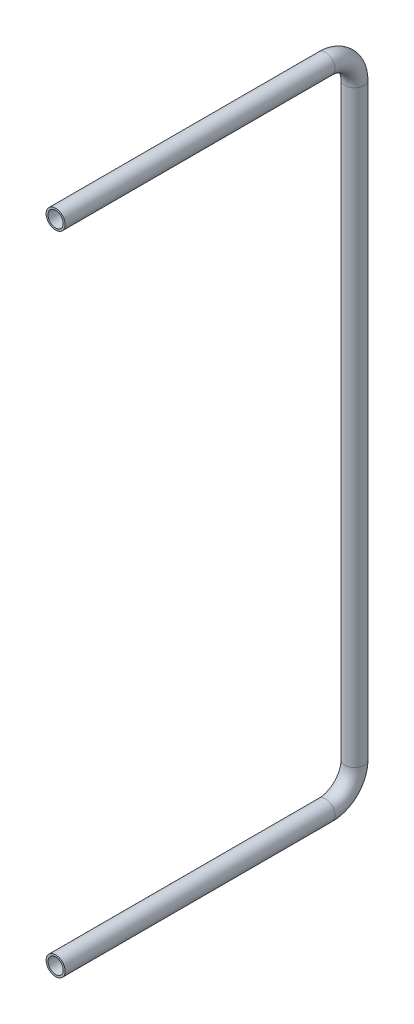
ISO-10303-21;
HEADER;
FILE_DESCRIPTION(('STEP AP214'),'2;1');
FILE_NAME('part.step','',(''),(''),'','','');
FILE_SCHEMA(('AUTOMOTIVE_DESIGN { 1 0 10303 214 1 1 1 1 }'));
ENDSEC;
DATA;
#1=APPLICATION_CONTEXT('core data for automotive mechanical design processes');
#2=APPLICATION_PROTOCOL_DEFINITION('international standard','automotive_design',2000,#1);
#3=PRODUCT_CONTEXT('',#1,'mechanical');
#4=PRODUCT('Part','Part','',(#3));
#5=PRODUCT_RELATED_PRODUCT_CATEGORY('part','',(#4));
#6=PRODUCT_DEFINITION_FORMATION('','',#4);
#7=PRODUCT_DEFINITION_CONTEXT('part definition',#1,'design');
#8=PRODUCT_DEFINITION('design','',#6,#7);
#9=PRODUCT_DEFINITION_SHAPE('','',#8);
#10=(LENGTH_UNIT() NAMED_UNIT(*) SI_UNIT(.MILLI.,.METRE.));
#11=(NAMED_UNIT(*) PLANE_ANGLE_UNIT() SI_UNIT($,.RADIAN.));
#12=(NAMED_UNIT(*) SI_UNIT($,.STERADIAN.) SOLID_ANGLE_UNIT());
#13=UNCERTAINTY_MEASURE_WITH_UNIT(LENGTH_MEASURE(1.E-05),#10,'distance_accuracy_value','');
#14=(GEOMETRIC_REPRESENTATION_CONTEXT(3) GLOBAL_UNCERTAINTY_ASSIGNED_CONTEXT((#13)) GLOBAL_UNIT_ASSIGNED_CONTEXT((#10,
#11,#12)) REPRESENTATION_CONTEXT('',''));
#15=CARTESIAN_POINT('',(0.,0.,0.));
#16=DIRECTION('',(0.,0.,1.));
#17=DIRECTION('',(1.,0.,0.));
#18=AXIS2_PLACEMENT_3D('',#15,#16,#17);
#19=CARTESIAN_POINT('',(0.,-1084.2625,-524.7005));
#20=DIRECTION('',(0.,1.,0.));
#21=DIRECTION('',(0.,0.,1.));
#22=AXIS2_PLACEMENT_3D('',#19,#20,#21);
#23=CYLINDRICAL_SURFACE('',#22,13.3223);
#24=CARTESIAN_POINT('',(0.,-50.8,-524.7005));
#25=DIRECTION('',(0.,1.,0.));
#26=DIRECTION('',(0.,0.,-1.));
#27=AXIS2_PLACEMENT_3D('',#24,#25,#26);
#28=CIRCLE('',#27,13.3223);
#29=CARTESIAN_POINT('',(0.,-50.8,-538.0228));
#30=VERTEX_POINT('',#29);
#31=EDGE_CURVE('E87',#30,#30,#28,.T.);
#32=ORIENTED_EDGE('',*,*,#31,.T.);
#33=EDGE_LOOP('',(#32));
#34=FACE_BOUND('',#33,.T.);
#35=CARTESIAN_POINT('',(0.,-1084.2625,-524.7005));
#36=DIRECTION('',(0.,1.,0.));
#37=DIRECTION('',(0.,0.,-1.));
#38=AXIS2_PLACEMENT_3D('',#35,#36,#37);
#39=CIRCLE('',#38,13.3223);
#40=CARTESIAN_POINT('',(0.,-1084.2625,-538.0228));
#41=VERTEX_POINT('',#40);
#42=EDGE_CURVE('E82',#41,#41,#39,.F.);
#43=ORIENTED_EDGE('',*,*,#42,.T.);
#44=EDGE_LOOP('',(#43));
#45=FACE_BOUND('',#44,.T.);
#46=ADVANCED_FACE('F15',(#34,#45),#23,.F.);
#47=CARTESIAN_POINT('',(0.,-50.8,-473.9005));
#48=DIRECTION('',(1.,0.,0.));
#49=DIRECTION('',(0.,0.,1.));
#50=AXIS2_PLACEMENT_3D('',#47,#48,#49);
#51=TOROIDAL_SURFACE('',#50,50.8,13.3223);
#52=CARTESIAN_POINT('',(0.,0.,-473.9005));
#53=DIRECTION('',(0.,0.,1.));
#54=DIRECTION('',(1.,0.,0.));
#55=AXIS2_PLACEMENT_3D('',#52,#53,#54);
#56=CIRCLE('',#55,13.3223);
#57=CARTESIAN_POINT('',(13.3223,0.,-473.9005));
#58=VERTEX_POINT('',#57);
#59=EDGE_CURVE('E80',#58,#58,#56,.T.);
#60=ORIENTED_EDGE('',*,*,#59,.T.);
#61=EDGE_LOOP('',(#60));
#62=FACE_BOUND('',#61,.T.);
#63=ORIENTED_EDGE('',*,*,#31,.F.);
#64=EDGE_LOOP('',(#63));
#65=FACE_BOUND('',#64,.T.);
#66=ADVANCED_FACE('F72',(#62,#65),#51,.F.);
#67=CARTESIAN_POINT('',(0.,-1084.2625,-473.9005));
#68=DIRECTION('',(1.,0.,0.));
#69=DIRECTION('',(0.,1.,0.));
#70=AXIS2_PLACEMENT_3D('',#67,#68,#69);
#71=TOROIDAL_SURFACE('',#70,50.8,13.3223);
#72=ORIENTED_EDGE('',*,*,#42,.F.);
#73=EDGE_LOOP('',(#72));
#74=FACE_BOUND('',#73,.T.);
#75=CARTESIAN_POINT('',(0.,-1135.0625,-473.9005));
#76=DIRECTION('',(0.,0.,-1.));
#77=DIRECTION('',(-1.,0.,0.));
#78=AXIS2_PLACEMENT_3D('',#75,#76,#77);
#79=CIRCLE('',#78,13.3223);
#80=CARTESIAN_POINT('',(-13.3223,-1135.0625,-473.9005));
#81=VERTEX_POINT('',#80);
#82=EDGE_CURVE('E78',#81,#81,#79,.F.);
#83=ORIENTED_EDGE('',*,*,#82,.T.);
#84=EDGE_LOOP('',(#83));
#85=FACE_BOUND('',#84,.T.);
#86=ADVANCED_FACE('F68',(#74,#85),#71,.F.);
#87=CARTESIAN_POINT('',(0.,0.,-473.9005));
#88=DIRECTION('',(0.,0.,1.));
#89=DIRECTION('',(1.,0.,0.));
#90=AXIS2_PLACEMENT_3D('',#87,#88,#89);
#91=CYLINDRICAL_SURFACE('',#90,13.3223);
#92=CARTESIAN_POINT('',(0.,0.,0.));
#93=DIRECTION('',(0.,0.,1.));
#94=DIRECTION('',(1.,0.,0.));
#95=AXIS2_PLACEMENT_3D('',#92,#93,#94);
#96=CIRCLE('',#95,13.3223);
#97=CARTESIAN_POINT('',(13.3223,0.,0.));
#98=VERTEX_POINT('',#97);
#99=EDGE_CURVE('E18',#98,#98,#96,.F.);
#100=ORIENTED_EDGE('',*,*,#99,.F.);
#101=EDGE_LOOP('',(#100));
#102=FACE_BOUND('',#101,.T.);
#103=ORIENTED_EDGE('',*,*,#59,.F.);
#104=EDGE_LOOP('',(#103));
#105=FACE_BOUND('',#104,.T.);
#106=ADVANCED_FACE('F64',(#102,#105),#91,.F.);
#107=CARTESIAN_POINT('',(0.,-1135.0625,0.));
#108=DIRECTION('',(0.,0.,-1.));
#109=DIRECTION('',(-1.,0.,0.));
#110=AXIS2_PLACEMENT_3D('',#107,#108,#109);
#111=CYLINDRICAL_SURFACE('',#110,13.3223);
#112=ORIENTED_EDGE('',*,*,#82,.F.);
#113=EDGE_LOOP('',(#112));
#114=FACE_BOUND('',#113,.T.);
#115=CARTESIAN_POINT('',(0.,-1135.0625,0.));
#116=DIRECTION('',(0.,0.,-1.));
#117=DIRECTION('',(-1.,0.,0.));
#118=AXIS2_PLACEMENT_3D('',#115,#116,#117);
#119=CIRCLE('',#118,13.3223);
#120=CARTESIAN_POINT('',(-13.3223,-1135.0625,0.));
#121=VERTEX_POINT('',#120);
#122=EDGE_CURVE('E96',#121,#121,#119,.F.);
#123=ORIENTED_EDGE('',*,*,#122,.T.);
#124=EDGE_LOOP('',(#123));
#125=FACE_BOUND('',#124,.T.);
#126=ADVANCED_FACE('F60',(#114,#125),#111,.F.);
#127=CARTESIAN_POINT('',(0.,0.,0.));
#128=DIRECTION('',(0.,0.,1.));
#129=DIRECTION('',(1.,0.,0.));
#130=AXIS2_PLACEMENT_3D('',#127,#128,#129);
#131=PLANE('',#130);
#132=ORIENTED_EDGE('',*,*,#99,.T.);
#133=EDGE_LOOP('',(#132));
#134=FACE_BOUND('',#133,.T.);
#135=CARTESIAN_POINT('',(0.,0.,0.));
#136=DIRECTION('',(0.,0.,1.));
#137=DIRECTION('',(1.,0.,0.));
#138=AXIS2_PLACEMENT_3D('',#135,#136,#137);
#139=CIRCLE('',#138,16.7005);
#140=CARTESIAN_POINT('',(16.7005,0.,0.));
#141=VERTEX_POINT('',#140);
#142=EDGE_CURVE('E94',#141,#141,#139,.F.);
#143=ORIENTED_EDGE('',*,*,#142,.F.);
#144=EDGE_LOOP('',(#143));
#145=FACE_BOUND('',#144,.T.);
#146=ADVANCED_FACE('F56',(#134,#145),#131,.T.);
#147=CARTESIAN_POINT('',(0.,-1135.0625,0.));
#148=DIRECTION('',(0.,0.,-1.));
#149=DIRECTION('',(-1.,0.,0.));
#150=AXIS2_PLACEMENT_3D('',#147,#148,#149);
#151=PLANE('',#150);
#152=ORIENTED_EDGE('',*,*,#122,.F.);
#153=EDGE_LOOP('',(#152));
#154=FACE_BOUND('',#153,.T.);
#155=CARTESIAN_POINT('',(0.,-1135.0625,0.));
#156=DIRECTION('',(0.,0.,-1.));
#157=DIRECTION('',(-1.,0.,0.));
#158=AXIS2_PLACEMENT_3D('',#155,#156,#157);
#159=CIRCLE('',#158,16.7005);
#160=CARTESIAN_POINT('',(-16.7005,-1135.0625,0.));
#161=VERTEX_POINT('',#160);
#162=EDGE_CURVE('E90',#161,#161,#159,.T.);
#163=ORIENTED_EDGE('',*,*,#162,.F.);
#164=EDGE_LOOP('',(#163));
#165=FACE_BOUND('',#164,.T.);
#166=ADVANCED_FACE('F52',(#154,#165),#151,.F.);
#167=CARTESIAN_POINT('',(0.,0.,-473.9005));
#168=DIRECTION('',(0.,0.,1.));
#169=DIRECTION('',(1.,0.,0.));
#170=AXIS2_PLACEMENT_3D('',#167,#168,#169);
#171=CYLINDRICAL_SURFACE('',#170,16.7005);
#172=ORIENTED_EDGE('',*,*,#142,.T.);
#173=EDGE_LOOP('',(#172));
#174=FACE_BOUND('',#173,.T.);
#175=CARTESIAN_POINT('',(0.,0.,-473.9005));
#176=DIRECTION('',(0.,0.,1.));
#177=DIRECTION('',(0.,1.,0.));
#178=AXIS2_PLACEMENT_3D('',#175,#176,#177);
#179=CIRCLE('',#178,16.7005);
#180=CARTESIAN_POINT('',(0.,16.7005,-473.9005));
#181=VERTEX_POINT('',#180);
#182=EDGE_CURVE('E93',#181,#181,#179,.F.);
#183=ORIENTED_EDGE('',*,*,#182,.F.);
#184=EDGE_LOOP('',(#183));
#185=FACE_BOUND('',#184,.T.);
#186=ADVANCED_FACE('F48',(#174,#185),#171,.T.);
#187=CARTESIAN_POINT('',(0.,-1135.0625,0.));
#188=DIRECTION('',(0.,0.,-1.));
#189=DIRECTION('',(-1.,0.,0.));
#190=AXIS2_PLACEMENT_3D('',#187,#188,#189);
#191=CYLINDRICAL_SURFACE('',#190,16.7005);
#192=CARTESIAN_POINT('',(0.,-1135.0625,-473.9005));
#193=DIRECTION('',(0.,0.,-1.));
#194=DIRECTION('',(0.,-1.,0.));
#195=AXIS2_PLACEMENT_3D('',#192,#193,#194);
#196=CIRCLE('',#195,16.7005);
#197=CARTESIAN_POINT('',(0.,-1151.763,-473.9005));
#198=VERTEX_POINT('',#197);
#199=EDGE_CURVE('E27',#198,#198,#196,.T.);
#200=ORIENTED_EDGE('',*,*,#199,.F.);
#201=EDGE_LOOP('',(#200));
#202=FACE_BOUND('',#201,.T.);
#203=ORIENTED_EDGE('',*,*,#162,.T.);
#204=EDGE_LOOP('',(#203));
#205=FACE_BOUND('',#204,.T.);
#206=ADVANCED_FACE('F44',(#202,#205),#191,.T.);
#207=CARTESIAN_POINT('',(0.,-50.8,-473.9005));
#208=DIRECTION('',(1.,0.,0.));
#209=DIRECTION('',(0.,0.,1.));
#210=AXIS2_PLACEMENT_3D('',#207,#208,#209);
#211=TOROIDAL_SURFACE('',#210,50.8,16.7005);
#212=ORIENTED_EDGE('',*,*,#182,.T.);
#213=EDGE_LOOP('',(#212));
#214=FACE_BOUND('',#213,.T.);
#215=CARTESIAN_POINT('',(0.,-50.8,-524.7005));
#216=DIRECTION('',(0.,1.,0.));
#217=DIRECTION('',(0.,0.,1.));
#218=AXIS2_PLACEMENT_3D('',#215,#216,#217);
#219=CIRCLE('',#218,16.7005);
#220=CARTESIAN_POINT('',(0.,-50.8,-508.));
#221=VERTEX_POINT('',#220);
#222=EDGE_CURVE('E22',#221,#221,#219,.F.);
#223=ORIENTED_EDGE('',*,*,#222,.F.);
#224=EDGE_LOOP('',(#223));
#225=FACE_BOUND('',#224,.T.);
#226=ADVANCED_FACE('F40',(#214,#225),#211,.T.);
#227=CARTESIAN_POINT('',(0.,-1084.2625,-473.9005));
#228=DIRECTION('',(1.,0.,0.));
#229=DIRECTION('',(0.,1.,0.));
#230=AXIS2_PLACEMENT_3D('',#227,#228,#229);
#231=TOROIDAL_SURFACE('',#230,50.8,16.7005);
#232=CARTESIAN_POINT('',(0.,-1084.2625,-524.7005));
#233=DIRECTION('',(0.,1.,0.));
#234=DIRECTION('',(0.,0.,1.));
#235=AXIS2_PLACEMENT_3D('',#232,#233,#234);
#236=CIRCLE('',#235,16.7005);
#237=CARTESIAN_POINT('',(0.,-1084.2625,-508.));
#238=VERTEX_POINT('',#237);
#239=EDGE_CURVE('E10',#238,#238,#236,.T.);
#240=ORIENTED_EDGE('',*,*,#239,.F.);
#241=EDGE_LOOP('',(#240));
#242=FACE_BOUND('',#241,.T.);
#243=ORIENTED_EDGE('',*,*,#199,.T.);
#244=EDGE_LOOP('',(#243));
#245=FACE_BOUND('',#244,.T.);
#246=ADVANCED_FACE('F35',(#242,#245),#231,.T.);
#247=CARTESIAN_POINT('',(0.,-1084.2625,-524.7005));
#248=DIRECTION('',(0.,1.,0.));
#249=DIRECTION('',(0.,0.,1.));
#250=AXIS2_PLACEMENT_3D('',#247,#248,#249);
#251=CYLINDRICAL_SURFACE('',#250,16.7005);
#252=ORIENTED_EDGE('',*,*,#222,.T.);
#253=EDGE_LOOP('',(#252));
#254=FACE_BOUND('',#253,.T.);
#255=ORIENTED_EDGE('',*,*,#239,.T.);
#256=EDGE_LOOP('',(#255));
#257=FACE_BOUND('',#256,.T.);
#258=ADVANCED_FACE('F39',(#254,#257),#251,.T.);
#259=CLOSED_SHELL('',(#46,#66,#86,#106,#126,#146,#166,#186,#206,#226,#246,#258));
#260=MANIFOLD_SOLID_BREP('B1',#259);
#261=ADVANCED_BREP_SHAPE_REPRESENTATION('',(#18,#260),#14);
#262=SHAPE_DEFINITION_REPRESENTATION(#9,#261);
ENDSEC;
END-ISO-10303-21;
